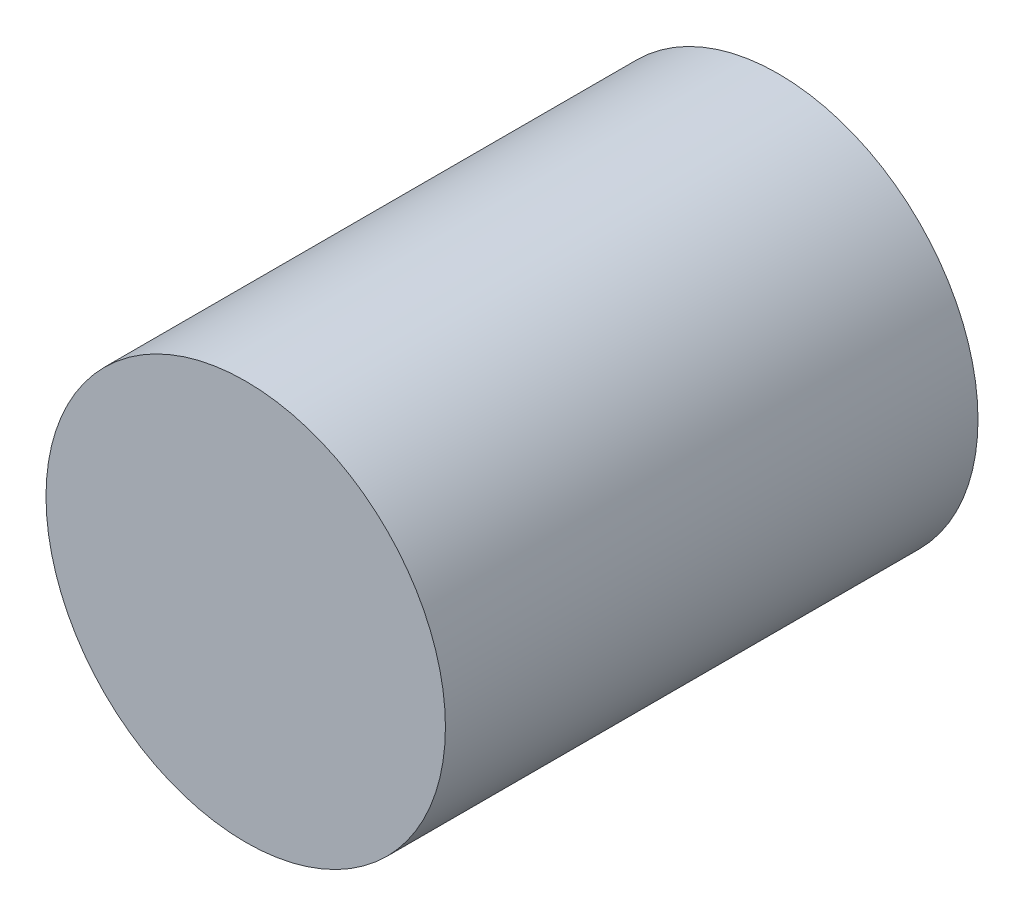
ISO-10303-21;
HEADER;
FILE_DESCRIPTION(('STEP AP214'),'2;1');
FILE_NAME('part.step','',(''),(''),'','','');
FILE_SCHEMA(('AUTOMOTIVE_DESIGN { 1 0 10303 214 1 1 1 1 }'));
ENDSEC;
DATA;
#1=APPLICATION_CONTEXT('core data for automotive mechanical design processes');
#2=APPLICATION_PROTOCOL_DEFINITION('international standard','automotive_design',2000,#1);
#3=PRODUCT_CONTEXT('',#1,'mechanical');
#4=PRODUCT('Part','Part','',(#3));
#5=PRODUCT_RELATED_PRODUCT_CATEGORY('part','',(#4));
#6=PRODUCT_DEFINITION_FORMATION('','',#4);
#7=PRODUCT_DEFINITION_CONTEXT('part definition',#1,'design');
#8=PRODUCT_DEFINITION('design','',#6,#7);
#9=PRODUCT_DEFINITION_SHAPE('','',#8);
#10=(LENGTH_UNIT() NAMED_UNIT(*) SI_UNIT(.MILLI.,.METRE.));
#11=(NAMED_UNIT(*) PLANE_ANGLE_UNIT() SI_UNIT($,.RADIAN.));
#12=(NAMED_UNIT(*) SI_UNIT($,.STERADIAN.) SOLID_ANGLE_UNIT());
#13=UNCERTAINTY_MEASURE_WITH_UNIT(LENGTH_MEASURE(1.E-05),#10,'distance_accuracy_value','');
#14=(GEOMETRIC_REPRESENTATION_CONTEXT(3) GLOBAL_UNCERTAINTY_ASSIGNED_CONTEXT((#13)) GLOBAL_UNIT_ASSIGNED_CONTEXT((#10,
#11,#12)) REPRESENTATION_CONTEXT('',''));
#15=CARTESIAN_POINT('',(0.,0.,0.));
#16=DIRECTION('',(0.,0.,1.));
#17=DIRECTION('',(1.,0.,0.));
#18=AXIS2_PLACEMENT_3D('',#15,#16,#17);
#19=CARTESIAN_POINT('',(0.,0.,4.));
#20=DIRECTION('',(0.,0.,-1.));
#21=DIRECTION('',(-1.,0.,0.));
#22=AXIS2_PLACEMENT_3D('',#19,#20,#21);
#23=CYLINDRICAL_SURFACE('',#22,1.5);
#24=CARTESIAN_POINT('',(0.,0.,4.));
#25=DIRECTION('',(0.,0.,1.));
#26=DIRECTION('',(1.,0.,0.));
#27=AXIS2_PLACEMENT_3D('',#24,#25,#26);
#28=CIRCLE('',#27,1.5);
#29=CARTESIAN_POINT('',(1.5,0.,4.));
#30=VERTEX_POINT('',#29);
#31=EDGE_CURVE('E10',#30,#30,#28,.T.);
#32=ORIENTED_EDGE('',*,*,#31,.F.);
#33=EDGE_LOOP('',(#32));
#34=FACE_BOUND('',#33,.T.);
#35=CARTESIAN_POINT('',(0.,0.,0.));
#36=DIRECTION('',(0.,0.,1.));
#37=DIRECTION('',(1.,0.,0.));
#38=AXIS2_PLACEMENT_3D('',#35,#36,#37);
#39=CIRCLE('',#38,1.5);
#40=CARTESIAN_POINT('',(1.5,0.,0.));
#41=VERTEX_POINT('',#40);
#42=EDGE_CURVE('E34',#41,#41,#39,.T.);
#43=ORIENTED_EDGE('',*,*,#42,.T.);
#44=EDGE_LOOP('',(#43));
#45=FACE_BOUND('',#44,.T.);
#46=ADVANCED_FACE('F31',(#34,#45),#23,.T.);
#47=CARTESIAN_POINT('',(0.,0.,4.));
#48=DIRECTION('',(0.,0.,1.));
#49=DIRECTION('',(1.,0.,0.));
#50=AXIS2_PLACEMENT_3D('',#47,#48,#49);
#51=PLANE('',#50);
#52=ORIENTED_EDGE('',*,*,#31,.T.);
#53=EDGE_LOOP('',(#52));
#54=FACE_BOUND('',#53,.T.);
#55=ADVANCED_FACE('F46',(#54),#51,.T.);
#56=CARTESIAN_POINT('',(0.,0.,0.));
#57=DIRECTION('',(0.,0.,1.));
#58=DIRECTION('',(1.,0.,0.));
#59=AXIS2_PLACEMENT_3D('',#56,#57,#58);
#60=PLANE('',#59);
#61=ORIENTED_EDGE('',*,*,#42,.F.);
#62=EDGE_LOOP('',(#61));
#63=FACE_BOUND('',#62,.T.);
#64=ADVANCED_FACE('F44',(#63),#60,.F.);
#65=CLOSED_SHELL('',(#46,#55,#64));
#66=MANIFOLD_SOLID_BREP('B2',#65);
#67=ADVANCED_BREP_SHAPE_REPRESENTATION('',(#18,#66),#14);
#68=SHAPE_DEFINITION_REPRESENTATION(#9,#67);
ENDSEC;
END-ISO-10303-21;
